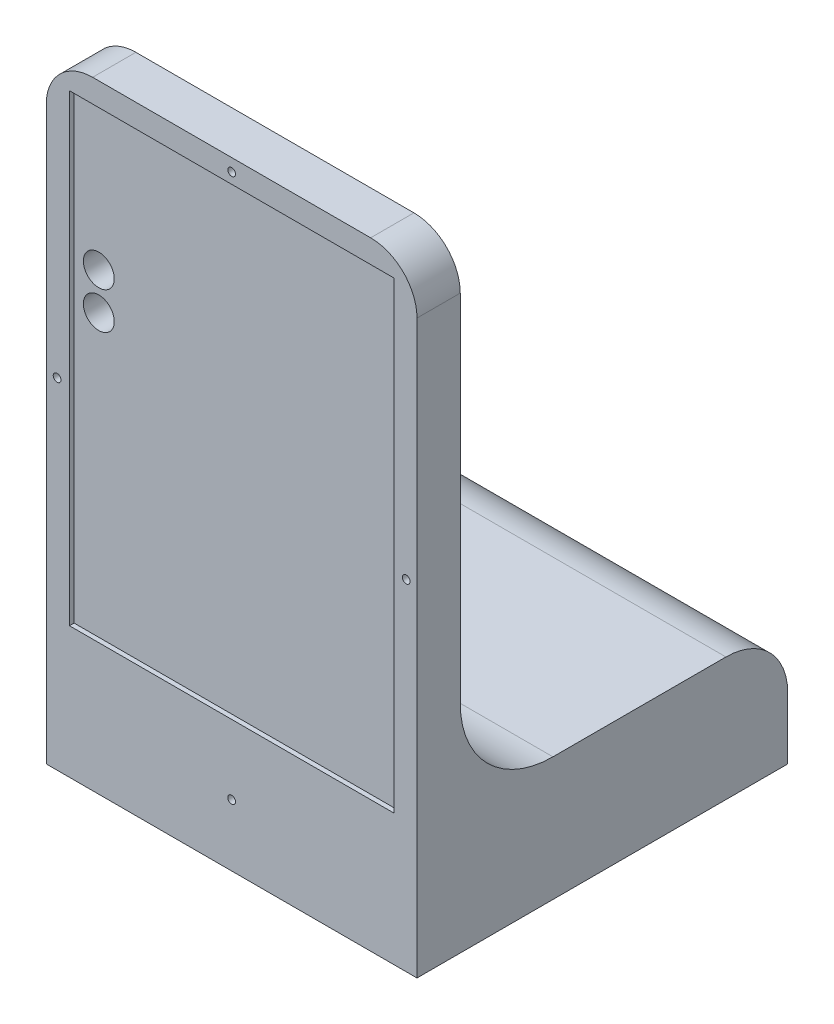
ISO-10303-21;
HEADER;
FILE_DESCRIPTION(('STEP AP214'),'2;1');
FILE_NAME('part.step','',(''),(''),'','','');
FILE_SCHEMA(('AUTOMOTIVE_DESIGN { 1 0 10303 214 1 1 1 1 }'));
ENDSEC;
DATA;
#1=APPLICATION_CONTEXT('core data for automotive mechanical design processes');
#2=APPLICATION_PROTOCOL_DEFINITION('international standard','automotive_design',2000,#1);
#3=PRODUCT_CONTEXT('',#1,'mechanical');
#4=PRODUCT('Part','Part','',(#3));
#5=PRODUCT_RELATED_PRODUCT_CATEGORY('part','',(#4));
#6=PRODUCT_DEFINITION_FORMATION('','',#4);
#7=PRODUCT_DEFINITION_CONTEXT('part definition',#1,'design');
#8=PRODUCT_DEFINITION('design','',#6,#7);
#9=PRODUCT_DEFINITION_SHAPE('','',#8);
#10=(LENGTH_UNIT() NAMED_UNIT(*) SI_UNIT(.MILLI.,.METRE.));
#11=(NAMED_UNIT(*) PLANE_ANGLE_UNIT() SI_UNIT($,.RADIAN.));
#12=(NAMED_UNIT(*) SI_UNIT($,.STERADIAN.) SOLID_ANGLE_UNIT());
#13=UNCERTAINTY_MEASURE_WITH_UNIT(LENGTH_MEASURE(1.E-05),#10,'distance_accuracy_value','');
#14=(GEOMETRIC_REPRESENTATION_CONTEXT(3) GLOBAL_UNCERTAINTY_ASSIGNED_CONTEXT((#13)) GLOBAL_UNIT_ASSIGNED_CONTEXT((#10,
#11,#12)) REPRESENTATION_CONTEXT('',''));
#15=CARTESIAN_POINT('',(0.,0.,0.));
#16=DIRECTION('',(0.,0.,1.));
#17=DIRECTION('',(1.,0.,0.));
#18=AXIS2_PLACEMENT_3D('',#15,#16,#17);
#19=CARTESIAN_POINT('',(0.,200.,25.));
#20=DIRECTION('',(0.,1.,0.));
#21=DIRECTION('',(0.,0.,1.));
#22=AXIS2_PLACEMENT_3D('',#19,#20,#21);
#23=PLANE('',#22);
#24=DIRECTION('',(0.,0.,-1.));
#25=VECTOR('',#24,1.);
#26=CARTESIAN_POINT('',(15.,200.,25.));
#27=LINE('',#26,#25);
#28=CARTESIAN_POINT('',(15.,200.,-25.));
#29=VERTEX_POINT('',#28);
#30=CARTESIAN_POINT('',(15.,200.,-11.));
#31=VERTEX_POINT('',#30);
#32=EDGE_CURVE('E208',#29,#31,#27,.F.);
#33=ORIENTED_EDGE('',*,*,#32,.T.);
#34=DIRECTION('',(-1.,0.,0.));
#35=VECTOR('',#34,1.);
#36=CARTESIAN_POINT('',(120.,200.,-11.));
#37=LINE('',#36,#35);
#38=CARTESIAN_POINT('',(105.,200.,-11.));
#39=VERTEX_POINT('',#38);
#40=EDGE_CURVE('E252',#39,#31,#37,.T.);
#41=ORIENTED_EDGE('',*,*,#40,.F.);
#42=DIRECTION('',(0.,0.,-1.));
#43=VECTOR('',#42,1.);
#44=CARTESIAN_POINT('',(105.,200.,-25.));
#45=LINE('',#44,#43);
#46=CARTESIAN_POINT('',(105.,200.,-25.));
#47=VERTEX_POINT('',#46);
#48=EDGE_CURVE('E205',#39,#47,#45,.T.);
#49=ORIENTED_EDGE('',*,*,#48,.T.);
#50=DIRECTION('',(1.,0.,0.));
#51=VECTOR('',#50,1.);
#52=CARTESIAN_POINT('',(0.,200.,-25.));
#53=LINE('',#52,#51);
#54=EDGE_CURVE('E345',#29,#47,#53,.T.);
#55=ORIENTED_EDGE('',*,*,#54,.F.);
#56=EDGE_LOOP('',(#33,#41,#49,#55));
#57=FACE_BOUND('',#56,.T.);
#58=ADVANCED_FACE('F44',(#57),#23,.T.);
#59=CARTESIAN_POINT('',(0.,0.,25.));
#60=DIRECTION('',(-1.,0.,0.));
#61=DIRECTION('',(0.,0.,1.));
#62=AXIS2_PLACEMENT_3D('',#59,#60,#61);
#63=PLANE('',#62);
#64=DIRECTION('',(0.,0.,1.));
#65=VECTOR('',#64,1.);
#66=CARTESIAN_POINT('',(0.,40.,-165.));
#67=LINE('',#66,#65);
#68=CARTESIAN_POINT('',(0.,40.,-111.));
#69=VERTEX_POINT('',#68);
#70=CARTESIAN_POINT('',(0.,40.,-55.));
#71=VERTEX_POINT('',#70);
#72=EDGE_CURVE('E342',#69,#71,#67,.T.);
#73=ORIENTED_EDGE('',*,*,#72,.F.);
#74=CARTESIAN_POINT('',(0.,20.,-111.));
#75=DIRECTION('',(-1.,0.,0.));
#76=DIRECTION('',(0.,0.,1.));
#77=AXIS2_PLACEMENT_3D('',#74,#75,#76);
#78=CIRCLE('',#77,20.);
#79=CARTESIAN_POINT('',(0.,20.,-131.));
#80=VERTEX_POINT('',#79);
#81=EDGE_CURVE('E11',#69,#80,#78,.T.);
#82=ORIENTED_EDGE('',*,*,#81,.T.);
#83=DIRECTION('',(0.,-1.,0.));
#84=VECTOR('',#83,1.);
#85=CARTESIAN_POINT('',(0.,40.,-131.));
#86=LINE('',#85,#84);
#87=CARTESIAN_POINT('',(0.,0.,-131.));
#88=VERTEX_POINT('',#87);
#89=EDGE_CURVE('E144',#80,#88,#86,.T.);
#90=ORIENTED_EDGE('',*,*,#89,.T.);
#91=DIRECTION('',(0.,0.,-1.));
#92=VECTOR('',#91,1.);
#93=CARTESIAN_POINT('',(0.,0.,25.));
#94=LINE('',#93,#92);
#95=CARTESIAN_POINT('',(0.,0.,-11.));
#96=VERTEX_POINT('',#95);
#97=EDGE_CURVE('E149',#96,#88,#94,.T.);
#98=ORIENTED_EDGE('',*,*,#97,.F.);
#99=DIRECTION('',(0.,1.,0.));
#100=VECTOR('',#99,1.);
#101=CARTESIAN_POINT('',(0.,200.,-11.));
#102=LINE('',#101,#100);
#103=CARTESIAN_POINT('',(0.,185.,-11.));
#104=VERTEX_POINT('',#103);
#105=EDGE_CURVE('E237',#96,#104,#102,.T.);
#106=ORIENTED_EDGE('',*,*,#105,.T.);
#107=DIRECTION('',(0.,0.,-1.));
#108=VECTOR('',#107,1.);
#109=CARTESIAN_POINT('',(0.,185.,25.));
#110=LINE('',#109,#108);
#111=CARTESIAN_POINT('',(0.,185.,-25.));
#112=VERTEX_POINT('',#111);
#113=EDGE_CURVE('E196',#104,#112,#110,.T.);
#114=ORIENTED_EDGE('',*,*,#113,.T.);
#115=DIRECTION('',(0.,1.,0.));
#116=VECTOR('',#115,1.);
#117=CARTESIAN_POINT('',(0.,0.,-25.));
#118=LINE('',#117,#116);
#119=CARTESIAN_POINT('',(0.,70.,-25.));
#120=VERTEX_POINT('',#119);
#121=EDGE_CURVE('E178',#120,#112,#118,.T.);
#122=ORIENTED_EDGE('',*,*,#121,.F.);
#123=CARTESIAN_POINT('',(0.,70.,-55.));
#124=DIRECTION('',(-1.,0.,0.));
#125=DIRECTION('',(0.,0.,1.));
#126=AXIS2_PLACEMENT_3D('',#123,#124,#125);
#127=CIRCLE('',#126,30.);
#128=EDGE_CURVE('E188',#120,#71,#127,.F.);
#129=ORIENTED_EDGE('',*,*,#128,.T.);
#130=EDGE_LOOP('',(#73,#82,#90,#98,#106,#114,#122,#129));
#131=FACE_BOUND('',#130,.T.);
#132=ADVANCED_FACE('F146',(#131),#63,.T.);
#133=CARTESIAN_POINT('',(0.,0.,25.));
#134=DIRECTION('',(0.,1.,0.));
#135=DIRECTION('',(0.,0.,1.));
#136=AXIS2_PLACEMENT_3D('',#133,#134,#135);
#137=PLANE('',#136);
#138=CARTESIAN_POINT('',(76.3226580762109,0.,-105.));
#139=DIRECTION('',(0.,-1.,0.));
#140=DIRECTION('',(0.,0.,-1.));
#141=AXIS2_PLACEMENT_3D('',#138,#139,#140);
#142=CIRCLE('',#141,1.25);
#143=CARTESIAN_POINT('',(76.3226580762109,0.,-106.25));
#144=VERTEX_POINT('',#143);
#145=EDGE_CURVE('E280',#144,#144,#142,.T.);
#146=ORIENTED_EDGE('',*,*,#145,.F.);
#147=EDGE_LOOP('',(#146));
#148=FACE_BOUND('',#147,.T.);
#149=CARTESIAN_POINT('',(46.3226580762109,0.,-105.));
#150=DIRECTION('',(0.,-1.,0.));
#151=DIRECTION('',(0.,0.,-1.));
#152=AXIS2_PLACEMENT_3D('',#149,#150,#151);
#153=CIRCLE('',#152,1.25);
#154=CARTESIAN_POINT('',(46.3226580762109,0.,-106.25));
#155=VERTEX_POINT('',#154);
#156=EDGE_CURVE('E276',#155,#155,#153,.T.);
#157=ORIENTED_EDGE('',*,*,#156,.F.);
#158=EDGE_LOOP('',(#157));
#159=FACE_BOUND('',#158,.T.);
#160=CARTESIAN_POINT('',(45.,0.,-85.));
#161=DIRECTION('',(0.,-1.,0.));
#162=DIRECTION('',(0.,0.,-1.));
#163=AXIS2_PLACEMENT_3D('',#160,#161,#162);
#164=CIRCLE('',#163,1.25);
#165=CARTESIAN_POINT('',(45.,0.,-86.25));
#166=VERTEX_POINT('',#165);
#167=EDGE_CURVE('E285',#166,#166,#164,.T.);
#168=ORIENTED_EDGE('',*,*,#167,.F.);
#169=EDGE_LOOP('',(#168));
#170=FACE_BOUND('',#169,.T.);
#171=CARTESIAN_POINT('',(75.,0.,-85.));
#172=DIRECTION('',(0.,-1.,0.));
#173=DIRECTION('',(0.,0.,-1.));
#174=AXIS2_PLACEMENT_3D('',#171,#172,#173);
#175=CIRCLE('',#174,1.25);
#176=CARTESIAN_POINT('',(75.,0.,-86.25));
#177=VERTEX_POINT('',#176);
#178=EDGE_CURVE('E293',#177,#177,#175,.T.);
#179=ORIENTED_EDGE('',*,*,#178,.F.);
#180=EDGE_LOOP('',(#179));
#181=FACE_BOUND('',#180,.T.);
#182=ORIENTED_EDGE('',*,*,#97,.T.);
#183=DIRECTION('',(1.,0.,0.));
#184=VECTOR('',#183,1.);
#185=CARTESIAN_POINT('',(0.,0.,-131.));
#186=LINE('',#185,#184);
#187=CARTESIAN_POINT('',(120.,0.,-131.));
#188=VERTEX_POINT('',#187);
#189=EDGE_CURVE('E155',#88,#188,#186,.T.);
#190=ORIENTED_EDGE('',*,*,#189,.T.);
#191=DIRECTION('',(0.,0.,-1.));
#192=VECTOR('',#191,1.);
#193=CARTESIAN_POINT('',(120.,0.,25.));
#194=LINE('',#193,#192);
#195=CARTESIAN_POINT('',(120.,0.,-11.));
#196=VERTEX_POINT('',#195);
#197=EDGE_CURVE('E171',#196,#188,#194,.T.);
#198=ORIENTED_EDGE('',*,*,#197,.F.);
#199=DIRECTION('',(-1.,0.,0.));
#200=VECTOR('',#199,1.);
#201=CARTESIAN_POINT('',(120.,0.,-11.));
#202=LINE('',#201,#200);
#203=EDGE_CURVE('E168',#196,#96,#202,.T.);
#204=ORIENTED_EDGE('',*,*,#203,.T.);
#205=EDGE_LOOP('',(#182,#190,#198,#204));
#206=FACE_BOUND('',#205,.T.);
#207=ADVANCED_FACE('F167',(#148,#159,#170,#181,#206),#137,.F.);
#208=CARTESIAN_POINT('',(120.,0.,25.));
#209=DIRECTION('',(-1.,0.,0.));
#210=DIRECTION('',(0.,0.,1.));
#211=AXIS2_PLACEMENT_3D('',#208,#209,#210);
#212=PLANE('',#211);
#213=DIRECTION('',(0.,-1.,0.));
#214=VECTOR('',#213,1.);
#215=CARTESIAN_POINT('',(120.,40.,-131.));
#216=LINE('',#215,#214);
#217=CARTESIAN_POINT('',(120.,20.,-131.));
#218=VERTEX_POINT('',#217);
#219=EDGE_CURVE('E156',#218,#188,#216,.T.);
#220=ORIENTED_EDGE('',*,*,#219,.F.);
#221=CARTESIAN_POINT('',(120.,20.,-111.));
#222=DIRECTION('',(-1.,0.,0.));
#223=DIRECTION('',(0.,0.,1.));
#224=AXIS2_PLACEMENT_3D('',#221,#222,#223);
#225=CIRCLE('',#224,20.);
#226=CARTESIAN_POINT('',(120.,40.,-111.));
#227=VERTEX_POINT('',#226);
#228=EDGE_CURVE('E67',#218,#227,#225,.F.);
#229=ORIENTED_EDGE('',*,*,#228,.T.);
#230=DIRECTION('',(0.,0.,1.));
#231=VECTOR('',#230,1.);
#232=CARTESIAN_POINT('',(120.,40.,-165.));
#233=LINE('',#232,#231);
#234=CARTESIAN_POINT('',(120.,40.,-55.));
#235=VERTEX_POINT('',#234);
#236=EDGE_CURVE('E328',#227,#235,#233,.T.);
#237=ORIENTED_EDGE('',*,*,#236,.T.);
#238=CARTESIAN_POINT('',(120.,70.,-55.));
#239=DIRECTION('',(-1.,0.,0.));
#240=DIRECTION('',(0.,0.,1.));
#241=AXIS2_PLACEMENT_3D('',#238,#239,#240);
#242=CIRCLE('',#241,30.);
#243=CARTESIAN_POINT('',(120.,70.,-25.));
#244=VERTEX_POINT('',#243);
#245=EDGE_CURVE('E185',#235,#244,#242,.T.);
#246=ORIENTED_EDGE('',*,*,#245,.T.);
#247=DIRECTION('',(0.,1.,0.));
#248=VECTOR('',#247,1.);
#249=CARTESIAN_POINT('',(120.,0.,-25.));
#250=LINE('',#249,#248);
#251=CARTESIAN_POINT('',(120.,185.,-25.));
#252=VERTEX_POINT('',#251);
#253=EDGE_CURVE('E348',#244,#252,#250,.T.);
#254=ORIENTED_EDGE('',*,*,#253,.T.);
#255=DIRECTION('',(0.,0.,-1.));
#256=VECTOR('',#255,1.);
#257=CARTESIAN_POINT('',(120.,185.,0.));
#258=LINE('',#257,#256);
#259=CARTESIAN_POINT('',(120.,185.,-11.));
#260=VERTEX_POINT('',#259);
#261=EDGE_CURVE('E192',#252,#260,#258,.F.);
#262=ORIENTED_EDGE('',*,*,#261,.T.);
#263=DIRECTION('',(0.,1.,0.));
#264=VECTOR('',#263,1.);
#265=CARTESIAN_POINT('',(120.,200.,-11.));
#266=LINE('',#265,#264);
#267=EDGE_CURVE('E249',#196,#260,#266,.T.);
#268=ORIENTED_EDGE('',*,*,#267,.F.);
#269=ORIENTED_EDGE('',*,*,#197,.T.);
#270=EDGE_LOOP('',(#220,#229,#237,#246,#254,#262,#268,#269));
#271=FACE_BOUND('',#270,.T.);
#272=ADVANCED_FACE('F222',(#271),#212,.F.);
#273=CARTESIAN_POINT('',(15.,185.,25.));
#274=DIRECTION('',(0.,0.,-1.));
#275=DIRECTION('',(-1.,0.,0.));
#276=AXIS2_PLACEMENT_3D('',#273,#274,#275);
#277=CYLINDRICAL_SURFACE('',#276,15.);
#278=ORIENTED_EDGE('',*,*,#113,.F.);
#279=CARTESIAN_POINT('',(15.,185.,-11.));
#280=DIRECTION('',(0.,0.,1.));
#281=DIRECTION('',(0.,-1.,0.));
#282=AXIS2_PLACEMENT_3D('',#279,#280,#281);
#283=CIRCLE('',#282,15.);
#284=EDGE_CURVE('E259',#104,#31,#283,.F.);
#285=ORIENTED_EDGE('',*,*,#284,.T.);
#286=ORIENTED_EDGE('',*,*,#32,.F.);
#287=CARTESIAN_POINT('',(15.,185.,-25.));
#288=DIRECTION('',(0.,0.,1.));
#289=DIRECTION('',(1.,0.,0.));
#290=AXIS2_PLACEMENT_3D('',#287,#288,#289);
#291=CIRCLE('',#290,15.);
#292=EDGE_CURVE('E202',#112,#29,#291,.F.);
#293=ORIENTED_EDGE('',*,*,#292,.F.);
#294=EDGE_LOOP('',(#278,#285,#286,#293));
#295=FACE_BOUND('',#294,.T.);
#296=ADVANCED_FACE('F392',(#295),#277,.T.);
#297=CARTESIAN_POINT('',(105.,185.,25.));
#298=DIRECTION('',(0.,0.,1.));
#299=DIRECTION('',(1.,0.,0.));
#300=AXIS2_PLACEMENT_3D('',#297,#298,#299);
#301=CYLINDRICAL_SURFACE('',#300,15.);
#302=ORIENTED_EDGE('',*,*,#48,.F.);
#303=CARTESIAN_POINT('',(105.,185.,-11.));
#304=DIRECTION('',(0.,0.,1.));
#305=DIRECTION('',(0.,-1.,0.));
#306=AXIS2_PLACEMENT_3D('',#303,#304,#305);
#307=CIRCLE('',#306,15.);
#308=EDGE_CURVE('E212',#39,#260,#307,.F.);
#309=ORIENTED_EDGE('',*,*,#308,.T.);
#310=ORIENTED_EDGE('',*,*,#261,.F.);
#311=CARTESIAN_POINT('',(105.,185.,-25.));
#312=DIRECTION('',(0.,0.,1.));
#313=DIRECTION('',(1.,0.,0.));
#314=AXIS2_PLACEMENT_3D('',#311,#312,#313);
#315=CIRCLE('',#314,15.);
#316=EDGE_CURVE('E199',#47,#252,#315,.F.);
#317=ORIENTED_EDGE('',*,*,#316,.F.);
#318=EDGE_LOOP('',(#302,#309,#310,#317));
#319=FACE_BOUND('',#318,.T.);
#320=ADVANCED_FACE('F394',(#319),#301,.T.);
#321=CARTESIAN_POINT('',(0.,0.,-25.));
#322=DIRECTION('',(0.,0.,1.));
#323=DIRECTION('',(1.,0.,0.));
#324=AXIS2_PLACEMENT_3D('',#321,#322,#323);
#325=PLANE('',#324);
#326=CARTESIAN_POINT('',(3.5,110.,-25.));
#327=DIRECTION('',(0.,0.,1.));
#328=DIRECTION('',(1.,0.,0.));
#329=AXIS2_PLACEMENT_3D('',#326,#327,#328);
#330=CIRCLE('',#329,1.25);
#331=CARTESIAN_POINT('',(4.75,110.,-25.));
#332=VERTEX_POINT('',#331);
#333=EDGE_CURVE('E811',#332,#332,#330,.T.);
#334=ORIENTED_EDGE('',*,*,#333,.T.);
#335=EDGE_LOOP('',(#334));
#336=FACE_BOUND('',#335,.T.);
#337=CARTESIAN_POINT('',(116.5,110.,-25.));
#338=DIRECTION('',(0.,0.,1.));
#339=DIRECTION('',(1.,0.,0.));
#340=AXIS2_PLACEMENT_3D('',#337,#338,#339);
#341=CIRCLE('',#340,1.25);
#342=CARTESIAN_POINT('',(117.75,110.,-25.));
#343=VERTEX_POINT('',#342);
#344=EDGE_CURVE('E813',#343,#343,#341,.T.);
#345=ORIENTED_EDGE('',*,*,#344,.T.);
#346=EDGE_LOOP('',(#345));
#347=FACE_BOUND('',#346,.T.);
#348=CARTESIAN_POINT('',(60.,195.964841853792,-25.));
#349=DIRECTION('',(0.,0.,1.));
#350=DIRECTION('',(1.,0.,0.));
#351=AXIS2_PLACEMENT_3D('',#348,#349,#350);
#352=CIRCLE('',#351,1.25);
#353=CARTESIAN_POINT('',(61.25,195.964841853792,-25.));
#354=VERTEX_POINT('',#353);
#355=EDGE_CURVE('E819',#354,#354,#352,.T.);
#356=ORIENTED_EDGE('',*,*,#355,.T.);
#357=EDGE_LOOP('',(#356));
#358=FACE_BOUND('',#357,.T.);
#359=ORIENTED_EDGE('',*,*,#121,.T.);
#360=ORIENTED_EDGE('',*,*,#292,.T.);
#361=ORIENTED_EDGE('',*,*,#54,.T.);
#362=ORIENTED_EDGE('',*,*,#316,.T.);
#363=ORIENTED_EDGE('',*,*,#253,.F.);
#364=DIRECTION('',(1.,0.,0.));
#365=VECTOR('',#364,1.);
#366=CARTESIAN_POINT('',(0.,70.,-25.));
#367=LINE('',#366,#365);
#368=EDGE_CURVE('E176',#244,#120,#367,.F.);
#369=ORIENTED_EDGE('',*,*,#368,.T.);
#370=EDGE_LOOP('',(#359,#360,#361,#362,#363,#369));
#371=FACE_BOUND('',#370,.T.);
#372=ADVANCED_FACE('F357',(#336,#347,#358,#371),#325,.F.);
#373=CARTESIAN_POINT('',(0.,40.,-165.));
#374=DIRECTION('',(0.,-1.,0.));
#375=DIRECTION('',(1.,0.,0.));
#376=AXIS2_PLACEMENT_3D('',#373,#374,#375);
#377=PLANE('',#376);
#378=ORIENTED_EDGE('',*,*,#236,.F.);
#379=DIRECTION('',(1.,0.,0.));
#380=VECTOR('',#379,1.);
#381=CARTESIAN_POINT('',(0.,40.,-111.));
#382=LINE('',#381,#380);
#383=EDGE_CURVE('E53',#227,#69,#382,.F.);
#384=ORIENTED_EDGE('',*,*,#383,.T.);
#385=ORIENTED_EDGE('',*,*,#72,.T.);
#386=DIRECTION('',(1.,0.,0.));
#387=VECTOR('',#386,1.);
#388=CARTESIAN_POINT('',(120.,40.,-55.));
#389=LINE('',#388,#387);
#390=EDGE_CURVE('E170',#71,#235,#389,.T.);
#391=ORIENTED_EDGE('',*,*,#390,.T.);
#392=EDGE_LOOP('',(#378,#384,#385,#391));
#393=FACE_BOUND('',#392,.T.);
#394=ADVANCED_FACE('F367',(#393),#377,.F.);
#395=CARTESIAN_POINT('',(0.,70.,-55.));
#396=DIRECTION('',(-1.,0.,0.));
#397=DIRECTION('',(0.,-1.,0.));
#398=AXIS2_PLACEMENT_3D('',#395,#396,#397);
#399=CYLINDRICAL_SURFACE('',#398,30.);
#400=ORIENTED_EDGE('',*,*,#128,.F.);
#401=ORIENTED_EDGE('',*,*,#368,.F.);
#402=ORIENTED_EDGE('',*,*,#245,.F.);
#403=ORIENTED_EDGE('',*,*,#390,.F.);
#404=EDGE_LOOP('',(#400,#401,#402,#403));
#405=FACE_BOUND('',#404,.T.);
#406=ADVANCED_FACE('F365',(#405),#399,.F.);
#407=CARTESIAN_POINT('',(76.3226580762109,5.,-105.));
#408=DIRECTION('',(0.,-1.,0.));
#409=DIRECTION('',(0.,0.,-1.));
#410=AXIS2_PLACEMENT_3D('',#407,#408,#409);
#411=CYLINDRICAL_SURFACE('',#410,1.25);
#412=CARTESIAN_POINT('',(76.3226580762109,5.,-105.));
#413=DIRECTION('',(0.,-1.,0.));
#414=DIRECTION('',(0.,0.,-1.));
#415=AXIS2_PLACEMENT_3D('',#412,#413,#414);
#416=CIRCLE('',#415,1.25);
#417=CARTESIAN_POINT('',(76.3226580762109,5.,-106.25));
#418=VERTEX_POINT('',#417);
#419=EDGE_CURVE('E300',#418,#418,#416,.T.);
#420=ORIENTED_EDGE('',*,*,#419,.F.);
#421=EDGE_LOOP('',(#420));
#422=FACE_BOUND('',#421,.T.);
#423=ORIENTED_EDGE('',*,*,#145,.T.);
#424=EDGE_LOOP('',(#423));
#425=FACE_BOUND('',#424,.T.);
#426=ADVANCED_FACE('F391',(#422,#425),#411,.F.);
#427=CARTESIAN_POINT('',(76.3226580762109,5.,-105.));
#428=DIRECTION('',(0.,-1.,0.));
#429=DIRECTION('',(0.,0.,-1.));
#430=AXIS2_PLACEMENT_3D('',#427,#428,#429);
#431=PLANE('',#430);
#432=ORIENTED_EDGE('',*,*,#419,.T.);
#433=EDGE_LOOP('',(#432));
#434=FACE_BOUND('',#433,.T.);
#435=ADVANCED_FACE('F477',(#434),#431,.T.);
#436=CARTESIAN_POINT('',(46.3226580762109,5.,-105.));
#437=DIRECTION('',(0.,-1.,0.));
#438=DIRECTION('',(0.,0.,-1.));
#439=AXIS2_PLACEMENT_3D('',#436,#437,#438);
#440=CYLINDRICAL_SURFACE('',#439,1.25);
#441=CARTESIAN_POINT('',(46.3226580762109,5.,-105.));
#442=DIRECTION('',(0.,-1.,0.));
#443=DIRECTION('',(0.,0.,-1.));
#444=AXIS2_PLACEMENT_3D('',#441,#442,#443);
#445=CIRCLE('',#444,1.25);
#446=CARTESIAN_POINT('',(46.3226580762109,5.,-106.25));
#447=VERTEX_POINT('',#446);
#448=EDGE_CURVE('E281',#447,#447,#445,.T.);
#449=ORIENTED_EDGE('',*,*,#448,.F.);
#450=EDGE_LOOP('',(#449));
#451=FACE_BOUND('',#450,.T.);
#452=ORIENTED_EDGE('',*,*,#156,.T.);
#453=EDGE_LOOP('',(#452));
#454=FACE_BOUND('',#453,.T.);
#455=ADVANCED_FACE('F480',(#451,#454),#440,.F.);
#456=CARTESIAN_POINT('',(46.3226580762109,5.,-105.));
#457=DIRECTION('',(0.,-1.,0.));
#458=DIRECTION('',(0.,0.,-1.));
#459=AXIS2_PLACEMENT_3D('',#456,#457,#458);
#460=PLANE('',#459);
#461=ORIENTED_EDGE('',*,*,#448,.T.);
#462=EDGE_LOOP('',(#461));
#463=FACE_BOUND('',#462,.T.);
#464=ADVANCED_FACE('F711',(#463),#460,.T.);
#465=CARTESIAN_POINT('',(45.,5.,-85.));
#466=DIRECTION('',(0.,-1.,0.));
#467=DIRECTION('',(0.,0.,-1.));
#468=AXIS2_PLACEMENT_3D('',#465,#466,#467);
#469=CYLINDRICAL_SURFACE('',#468,1.25);
#470=CARTESIAN_POINT('',(45.,5.,-85.));
#471=DIRECTION('',(0.,-1.,0.));
#472=DIRECTION('',(0.,0.,-1.));
#473=AXIS2_PLACEMENT_3D('',#470,#471,#472);
#474=CIRCLE('',#473,1.25);
#475=CARTESIAN_POINT('',(45.,5.,-86.25));
#476=VERTEX_POINT('',#475);
#477=EDGE_CURVE('E289',#476,#476,#474,.T.);
#478=ORIENTED_EDGE('',*,*,#477,.F.);
#479=EDGE_LOOP('',(#478));
#480=FACE_BOUND('',#479,.T.);
#481=ORIENTED_EDGE('',*,*,#167,.T.);
#482=EDGE_LOOP('',(#481));
#483=FACE_BOUND('',#482,.T.);
#484=ADVANCED_FACE('F471',(#480,#483),#469,.F.);
#485=CARTESIAN_POINT('',(45.,5.,-85.));
#486=DIRECTION('',(0.,-1.,0.));
#487=DIRECTION('',(0.,0.,-1.));
#488=AXIS2_PLACEMENT_3D('',#485,#486,#487);
#489=PLANE('',#488);
#490=ORIENTED_EDGE('',*,*,#477,.T.);
#491=EDGE_LOOP('',(#490));
#492=FACE_BOUND('',#491,.T.);
#493=ADVANCED_FACE('F462',(#492),#489,.T.);
#494=CARTESIAN_POINT('',(75.,5.,-85.));
#495=DIRECTION('',(0.,-1.,0.));
#496=DIRECTION('',(0.,0.,-1.));
#497=AXIS2_PLACEMENT_3D('',#494,#495,#496);
#498=CYLINDRICAL_SURFACE('',#497,1.25);
#499=CARTESIAN_POINT('',(75.,5.,-85.));
#500=DIRECTION('',(0.,-1.,0.));
#501=DIRECTION('',(0.,0.,-1.));
#502=AXIS2_PLACEMENT_3D('',#499,#500,#501);
#503=CIRCLE('',#502,1.25);
#504=CARTESIAN_POINT('',(75.,5.,-86.25));
#505=VERTEX_POINT('',#504);
#506=EDGE_CURVE('E275',#505,#505,#503,.T.);
#507=ORIENTED_EDGE('',*,*,#506,.F.);
#508=EDGE_LOOP('',(#507));
#509=FACE_BOUND('',#508,.T.);
#510=ORIENTED_EDGE('',*,*,#178,.T.);
#511=EDGE_LOOP('',(#510));
#512=FACE_BOUND('',#511,.T.);
#513=ADVANCED_FACE('F460',(#509,#512),#498,.F.);
#514=CARTESIAN_POINT('',(75.,5.,-85.));
#515=DIRECTION('',(0.,-1.,0.));
#516=DIRECTION('',(0.,0.,-1.));
#517=AXIS2_PLACEMENT_3D('',#514,#515,#516);
#518=PLANE('',#517);
#519=ORIENTED_EDGE('',*,*,#506,.T.);
#520=EDGE_LOOP('',(#519));
#521=FACE_BOUND('',#520,.T.);
#522=ADVANCED_FACE('F412',(#521),#518,.T.);
#523=CARTESIAN_POINT('',(120.,200.,-11.));
#524=DIRECTION('',(0.,0.,1.));
#525=DIRECTION('',(0.,-1.,0.));
#526=AXIS2_PLACEMENT_3D('',#523,#524,#525);
#527=PLANE('',#526);
#528=CARTESIAN_POINT('',(3.5,110.,-11.));
#529=DIRECTION('',(0.,0.,1.));
#530=DIRECTION('',(1.,0.,0.));
#531=AXIS2_PLACEMENT_3D('',#528,#529,#530);
#532=CIRCLE('',#531,1.25);
#533=CARTESIAN_POINT('',(4.75,110.,-11.));
#534=VERTEX_POINT('',#533);
#535=EDGE_CURVE('E808',#534,#534,#532,.T.);
#536=ORIENTED_EDGE('',*,*,#535,.F.);
#537=EDGE_LOOP('',(#536));
#538=FACE_BOUND('',#537,.T.);
#539=CARTESIAN_POINT('',(116.5,110.,-11.));
#540=DIRECTION('',(0.,0.,1.));
#541=DIRECTION('',(1.,0.,0.));
#542=AXIS2_PLACEMENT_3D('',#539,#540,#541);
#543=CIRCLE('',#542,1.25);
#544=CARTESIAN_POINT('',(117.75,110.,-11.));
#545=VERTEX_POINT('',#544);
#546=EDGE_CURVE('E829',#545,#545,#543,.T.);
#547=ORIENTED_EDGE('',*,*,#546,.F.);
#548=EDGE_LOOP('',(#547));
#549=FACE_BOUND('',#548,.T.);
#550=CARTESIAN_POINT('',(60.,195.964841853792,-11.));
#551=DIRECTION('',(0.,0.,1.));
#552=DIRECTION('',(1.,0.,0.));
#553=AXIS2_PLACEMENT_3D('',#550,#551,#552);
#554=CIRCLE('',#553,1.25);
#555=CARTESIAN_POINT('',(61.25,195.964841853792,-11.));
#556=VERTEX_POINT('',#555);
#557=EDGE_CURVE('E825',#556,#556,#554,.T.);
#558=ORIENTED_EDGE('',*,*,#557,.F.);
#559=EDGE_LOOP('',(#558));
#560=FACE_BOUND('',#559,.T.);
#561=CARTESIAN_POINT('',(60.,20.,-11.));
#562=DIRECTION('',(0.,0.,1.));
#563=DIRECTION('',(1.,0.,0.));
#564=AXIS2_PLACEMENT_3D('',#561,#562,#563);
#565=CIRCLE('',#564,1.25);
#566=CARTESIAN_POINT('',(61.25,20.,-11.));
#567=VERTEX_POINT('',#566);
#568=EDGE_CURVE('E229',#567,#567,#565,.T.);
#569=ORIENTED_EDGE('',*,*,#568,.F.);
#570=EDGE_LOOP('',(#569));
#571=FACE_BOUND('',#570,.T.);
#572=ORIENTED_EDGE('',*,*,#105,.F.);
#573=ORIENTED_EDGE('',*,*,#203,.F.);
#574=ORIENTED_EDGE('',*,*,#267,.T.);
#575=ORIENTED_EDGE('',*,*,#308,.F.);
#576=ORIENTED_EDGE('',*,*,#40,.T.);
#577=ORIENTED_EDGE('',*,*,#284,.F.);
#578=EDGE_LOOP('',(#572,#573,#574,#575,#576,#577));
#579=FACE_BOUND('',#578,.T.);
#580=DIRECTION('',(0.,1.,0.));
#581=VECTOR('',#580,1.);
#582=CARTESIAN_POINT('',(7.49999999999999,192.5,-11.));
#583=LINE('',#582,#581);
#584=CARTESIAN_POINT('',(7.50000000000001,42.5,-11.));
#585=VERTEX_POINT('',#584);
#586=CARTESIAN_POINT('',(7.49999999999999,192.5,-11.));
#587=VERTEX_POINT('',#586);
#588=EDGE_CURVE('E272',#585,#587,#583,.T.);
#589=ORIENTED_EDGE('',*,*,#588,.T.);
#590=DIRECTION('',(1.,0.,0.));
#591=VECTOR('',#590,1.);
#592=CARTESIAN_POINT('',(7.49999999999999,192.5,-11.));
#593=LINE('',#592,#591);
#594=CARTESIAN_POINT('',(112.5,192.5,-11.));
#595=VERTEX_POINT('',#594);
#596=EDGE_CURVE('E269',#587,#595,#593,.T.);
#597=ORIENTED_EDGE('',*,*,#596,.T.);
#598=DIRECTION('',(0.,-1.,0.));
#599=VECTOR('',#598,1.);
#600=CARTESIAN_POINT('',(112.5,192.5,-11.));
#601=LINE('',#600,#599);
#602=CARTESIAN_POINT('',(112.5,42.5,-11.));
#603=VERTEX_POINT('',#602);
#604=EDGE_CURVE('E266',#595,#603,#601,.T.);
#605=ORIENTED_EDGE('',*,*,#604,.T.);
#606=DIRECTION('',(-1.,0.,0.));
#607=VECTOR('',#606,1.);
#608=CARTESIAN_POINT('',(7.50000000000001,42.5,-11.));
#609=LINE('',#608,#607);
#610=EDGE_CURVE('E263',#603,#585,#609,.T.);
#611=ORIENTED_EDGE('',*,*,#610,.T.);
#612=EDGE_LOOP('',(#589,#597,#605,#611));
#613=FACE_BOUND('',#612,.T.);
#614=ADVANCED_FACE('F408',(#538,#549,#560,#571,#579,#613),#527,.T.);
#615=CARTESIAN_POINT('',(0.,0.,-12.5));
#616=DIRECTION('',(0.,0.,1.));
#617=DIRECTION('',(1.,0.,0.));
#618=AXIS2_PLACEMENT_3D('',#615,#616,#617);
#619=PLANE('',#618);
#620=CARTESIAN_POINT('',(15.5,145.5,-12.5));
#621=DIRECTION('',(0.,0.,1.));
#622=DIRECTION('',(1.,0.,0.));
#623=AXIS2_PLACEMENT_3D('',#620,#621,#622);
#624=CIRCLE('',#623,5.);
#625=CARTESIAN_POINT('',(20.5,145.5,-12.5));
#626=VERTEX_POINT('',#625);
#627=EDGE_CURVE('E238',#626,#626,#624,.T.);
#628=ORIENTED_EDGE('',*,*,#627,.F.);
#629=EDGE_LOOP('',(#628));
#630=FACE_BOUND('',#629,.T.);
#631=CARTESIAN_POINT('',(15.5,133.5,-12.5));
#632=DIRECTION('',(0.,0.,1.));
#633=DIRECTION('',(1.,0.,0.));
#634=AXIS2_PLACEMENT_3D('',#631,#632,#633);
#635=CIRCLE('',#634,5.);
#636=CARTESIAN_POINT('',(20.5,133.5,-12.5));
#637=VERTEX_POINT('',#636);
#638=EDGE_CURVE('E242',#637,#637,#635,.T.);
#639=ORIENTED_EDGE('',*,*,#638,.F.);
#640=EDGE_LOOP('',(#639));
#641=FACE_BOUND('',#640,.T.);
#642=DIRECTION('',(0.,-1.,0.));
#643=VECTOR('',#642,1.);
#644=CARTESIAN_POINT('',(7.49999999999999,192.5,-12.5));
#645=LINE('',#644,#643);
#646=CARTESIAN_POINT('',(7.49999999999999,192.5,-12.5));
#647=VERTEX_POINT('',#646);
#648=CARTESIAN_POINT('',(7.50000000000001,42.5,-12.5));
#649=VERTEX_POINT('',#648);
#650=EDGE_CURVE('E304',#647,#649,#645,.T.);
#651=ORIENTED_EDGE('',*,*,#650,.T.);
#652=DIRECTION('',(1.,0.,0.));
#653=VECTOR('',#652,1.);
#654=CARTESIAN_POINT('',(7.50000000000001,42.5,-12.5));
#655=LINE('',#654,#653);
#656=CARTESIAN_POINT('',(112.5,42.5,-12.5));
#657=VERTEX_POINT('',#656);
#658=EDGE_CURVE('E311',#649,#657,#655,.T.);
#659=ORIENTED_EDGE('',*,*,#658,.T.);
#660=DIRECTION('',(0.,1.,0.));
#661=VECTOR('',#660,1.);
#662=CARTESIAN_POINT('',(112.5,192.5,-12.5));
#663=LINE('',#662,#661);
#664=CARTESIAN_POINT('',(112.5,192.5,-12.5));
#665=VERTEX_POINT('',#664);
#666=EDGE_CURVE('E315',#657,#665,#663,.T.);
#667=ORIENTED_EDGE('',*,*,#666,.T.);
#668=DIRECTION('',(-1.,0.,0.));
#669=VECTOR('',#668,1.);
#670=CARTESIAN_POINT('',(7.49999999999999,192.5,-12.5));
#671=LINE('',#670,#669);
#672=EDGE_CURVE('E319',#665,#647,#671,.T.);
#673=ORIENTED_EDGE('',*,*,#672,.T.);
#674=EDGE_LOOP('',(#651,#659,#667,#673));
#675=FACE_BOUND('',#674,.T.);
#676=ADVANCED_FACE('F411',(#630,#641,#675),#619,.T.);
#677=CARTESIAN_POINT('',(7.50000000000001,42.5,-12.5));
#678=DIRECTION('',(0.,-1.,0.));
#679=DIRECTION('',(0.,0.,-1.));
#680=AXIS2_PLACEMENT_3D('',#677,#678,#679);
#681=PLANE('',#680);
#682=ORIENTED_EDGE('',*,*,#610,.F.);
#683=DIRECTION('',(0.,0.,1.));
#684=VECTOR('',#683,1.);
#685=CARTESIAN_POINT('',(112.5,42.5,-12.5));
#686=LINE('',#685,#684);
#687=EDGE_CURVE('E333',#657,#603,#686,.T.);
#688=ORIENTED_EDGE('',*,*,#687,.F.);
#689=ORIENTED_EDGE('',*,*,#658,.F.);
#690=DIRECTION('',(0.,0.,1.));
#691=VECTOR('',#690,1.);
#692=CARTESIAN_POINT('',(7.50000000000001,42.5,-12.5));
#693=LINE('',#692,#691);
#694=EDGE_CURVE('E323',#649,#585,#693,.T.);
#695=ORIENTED_EDGE('',*,*,#694,.T.);
#696=EDGE_LOOP('',(#682,#688,#689,#695));
#697=FACE_BOUND('',#696,.T.);
#698=ADVANCED_FACE('F431',(#697),#681,.F.);
#699=CARTESIAN_POINT('',(112.5,192.5,-12.5));
#700=DIRECTION('',(1.,0.,0.));
#701=DIRECTION('',(0.,1.,0.));
#702=AXIS2_PLACEMENT_3D('',#699,#700,#701);
#703=PLANE('',#702);
#704=ORIENTED_EDGE('',*,*,#604,.F.);
#705=DIRECTION('',(0.,0.,1.));
#706=VECTOR('',#705,1.);
#707=CARTESIAN_POINT('',(112.5,192.5,-12.5));
#708=LINE('',#707,#706);
#709=EDGE_CURVE('E329',#665,#595,#708,.T.);
#710=ORIENTED_EDGE('',*,*,#709,.F.);
#711=ORIENTED_EDGE('',*,*,#666,.F.);
#712=ORIENTED_EDGE('',*,*,#687,.T.);
#713=EDGE_LOOP('',(#704,#710,#711,#712));
#714=FACE_BOUND('',#713,.T.);
#715=ADVANCED_FACE('F429',(#714),#703,.F.);
#716=CARTESIAN_POINT('',(7.49999999999999,192.5,-12.5));
#717=DIRECTION('',(0.,1.,0.));
#718=DIRECTION('',(0.,0.,1.));
#719=AXIS2_PLACEMENT_3D('',#716,#717,#718);
#720=PLANE('',#719);
#721=ORIENTED_EDGE('',*,*,#596,.F.);
#722=DIRECTION('',(0.,0.,1.));
#723=VECTOR('',#722,1.);
#724=CARTESIAN_POINT('',(7.49999999999999,192.5,-12.5));
#725=LINE('',#724,#723);
#726=EDGE_CURVE('E324',#647,#587,#725,.T.);
#727=ORIENTED_EDGE('',*,*,#726,.F.);
#728=ORIENTED_EDGE('',*,*,#672,.F.);
#729=ORIENTED_EDGE('',*,*,#709,.T.);
#730=EDGE_LOOP('',(#721,#727,#728,#729));
#731=FACE_BOUND('',#730,.T.);
#732=ADVANCED_FACE('F421',(#731),#720,.F.);
#733=CARTESIAN_POINT('',(7.49999999999999,192.5,-12.5));
#734=DIRECTION('',(-1.,0.,0.));
#735=DIRECTION('',(0.,-1.,0.));
#736=AXIS2_PLACEMENT_3D('',#733,#734,#735);
#737=PLANE('',#736);
#738=ORIENTED_EDGE('',*,*,#588,.F.);
#739=ORIENTED_EDGE('',*,*,#694,.F.);
#740=ORIENTED_EDGE('',*,*,#650,.F.);
#741=ORIENTED_EDGE('',*,*,#726,.T.);
#742=EDGE_LOOP('',(#738,#739,#740,#741));
#743=FACE_BOUND('',#742,.T.);
#744=ADVANCED_FACE('F424',(#743),#737,.F.);
#745=CARTESIAN_POINT('',(15.5,133.5,-23.5));
#746=DIRECTION('',(0.,0.,1.));
#747=DIRECTION('',(1.,0.,0.));
#748=AXIS2_PLACEMENT_3D('',#745,#746,#747);
#749=CYLINDRICAL_SURFACE('',#748,5.);
#750=CARTESIAN_POINT('',(15.5,133.5,-23.5));
#751=DIRECTION('',(0.,0.,1.));
#752=DIRECTION('',(1.,0.,0.));
#753=AXIS2_PLACEMENT_3D('',#750,#751,#752);
#754=CIRCLE('',#753,5.);
#755=CARTESIAN_POINT('',(20.5,133.5,-23.5));
#756=VERTEX_POINT('',#755);
#757=EDGE_CURVE('E164',#756,#756,#754,.T.);
#758=ORIENTED_EDGE('',*,*,#757,.F.);
#759=EDGE_LOOP('',(#758));
#760=FACE_BOUND('',#759,.T.);
#761=ORIENTED_EDGE('',*,*,#638,.T.);
#762=EDGE_LOOP('',(#761));
#763=FACE_BOUND('',#762,.T.);
#764=ADVANCED_FACE('F445',(#760,#763),#749,.F.);
#765=CARTESIAN_POINT('',(15.5,133.5,-23.5));
#766=DIRECTION('',(0.,0.,1.));
#767=DIRECTION('',(1.,0.,0.));
#768=AXIS2_PLACEMENT_3D('',#765,#766,#767);
#769=PLANE('',#768);
#770=ORIENTED_EDGE('',*,*,#757,.T.);
#771=EDGE_LOOP('',(#770));
#772=FACE_BOUND('',#771,.T.);
#773=ADVANCED_FACE('F500',(#772),#769,.T.);
#774=CARTESIAN_POINT('',(15.5,145.5,-23.5));
#775=DIRECTION('',(0.,0.,1.));
#776=DIRECTION('',(1.,0.,0.));
#777=AXIS2_PLACEMENT_3D('',#774,#775,#776);
#778=CYLINDRICAL_SURFACE('',#777,5.);
#779=CARTESIAN_POINT('',(15.5,145.5,-23.5));
#780=DIRECTION('',(0.,0.,1.));
#781=DIRECTION('',(1.,0.,0.));
#782=AXIS2_PLACEMENT_3D('',#779,#780,#781);
#783=CIRCLE('',#782,5.);
#784=CARTESIAN_POINT('',(20.5,145.5,-23.5));
#785=VERTEX_POINT('',#784);
#786=EDGE_CURVE('E233',#785,#785,#783,.T.);
#787=ORIENTED_EDGE('',*,*,#786,.F.);
#788=EDGE_LOOP('',(#787));
#789=FACE_BOUND('',#788,.T.);
#790=ORIENTED_EDGE('',*,*,#627,.T.);
#791=EDGE_LOOP('',(#790));
#792=FACE_BOUND('',#791,.T.);
#793=ADVANCED_FACE('F508',(#789,#792),#778,.F.);
#794=CARTESIAN_POINT('',(15.5,145.5,-23.5));
#795=DIRECTION('',(0.,0.,1.));
#796=DIRECTION('',(1.,0.,0.));
#797=AXIS2_PLACEMENT_3D('',#794,#795,#796);
#798=PLANE('',#797);
#799=ORIENTED_EDGE('',*,*,#786,.T.);
#800=EDGE_LOOP('',(#799));
#801=FACE_BOUND('',#800,.T.);
#802=ADVANCED_FACE('F377',(#801),#798,.T.);
#803=CARTESIAN_POINT('',(0.,40.,-131.));
#804=DIRECTION('',(0.,0.,1.));
#805=DIRECTION('',(1.,0.,0.));
#806=AXIS2_PLACEMENT_3D('',#803,#804,#805);
#807=PLANE('',#806);
#808=ORIENTED_EDGE('',*,*,#89,.F.);
#809=DIRECTION('',(1.,0.,0.));
#810=VECTOR('',#809,1.);
#811=CARTESIAN_POINT('',(0.,20.,-131.));
#812=LINE('',#811,#810);
#813=EDGE_CURVE('E216',#80,#218,#812,.T.);
#814=ORIENTED_EDGE('',*,*,#813,.T.);
#815=ORIENTED_EDGE('',*,*,#219,.T.);
#816=ORIENTED_EDGE('',*,*,#189,.F.);
#817=EDGE_LOOP('',(#808,#814,#815,#816));
#818=FACE_BOUND('',#817,.T.);
#819=ADVANCED_FACE('F159',(#818),#807,.F.);
#820=CARTESIAN_POINT('',(0.,20.,-111.));
#821=DIRECTION('',(1.,0.,0.));
#822=DIRECTION('',(0.,1.,0.));
#823=AXIS2_PLACEMENT_3D('',#820,#821,#822);
#824=CYLINDRICAL_SURFACE('',#823,20.);
#825=ORIENTED_EDGE('',*,*,#81,.F.);
#826=ORIENTED_EDGE('',*,*,#383,.F.);
#827=ORIENTED_EDGE('',*,*,#228,.F.);
#828=ORIENTED_EDGE('',*,*,#813,.F.);
#829=EDGE_LOOP('',(#825,#826,#827,#828));
#830=FACE_BOUND('',#829,.T.);
#831=ADVANCED_FACE('F46',(#830),#824,.T.);
#832=CARTESIAN_POINT('',(60.,20.,-15.));
#833=DIRECTION('',(0.,0.,1.));
#834=DIRECTION('',(1.,0.,0.));
#835=AXIS2_PLACEMENT_3D('',#832,#833,#834);
#836=CYLINDRICAL_SURFACE('',#835,1.25);
#837=CARTESIAN_POINT('',(60.,20.,-15.));
#838=DIRECTION('',(0.,0.,1.));
#839=DIRECTION('',(1.,0.,0.));
#840=AXIS2_PLACEMENT_3D('',#837,#838,#839);
#841=CIRCLE('',#840,1.25);
#842=CARTESIAN_POINT('',(61.25,20.,-15.));
#843=VERTEX_POINT('',#842);
#844=EDGE_CURVE('E225',#843,#843,#841,.T.);
#845=ORIENTED_EDGE('',*,*,#844,.F.);
#846=EDGE_LOOP('',(#845));
#847=FACE_BOUND('',#846,.T.);
#848=ORIENTED_EDGE('',*,*,#568,.T.);
#849=EDGE_LOOP('',(#848));
#850=FACE_BOUND('',#849,.T.);
#851=ADVANCED_FACE('F369',(#847,#850),#836,.F.);
#852=CARTESIAN_POINT('',(60.,20.,-15.));
#853=DIRECTION('',(0.,0.,1.));
#854=DIRECTION('',(1.,0.,0.));
#855=AXIS2_PLACEMENT_3D('',#852,#853,#854);
#856=PLANE('',#855);
#857=ORIENTED_EDGE('',*,*,#844,.T.);
#858=EDGE_LOOP('',(#857));
#859=FACE_BOUND('',#858,.T.);
#860=ADVANCED_FACE('F374',(#859),#856,.T.);
#861=CARTESIAN_POINT('',(60.,195.964841853792,-131.));
#862=DIRECTION('',(0.,0.,1.));
#863=DIRECTION('',(1.,0.,0.));
#864=AXIS2_PLACEMENT_3D('',#861,#862,#863);
#865=CYLINDRICAL_SURFACE('',#864,1.25);
#866=ORIENTED_EDGE('',*,*,#557,.T.);
#867=EDGE_LOOP('',(#866));
#868=FACE_BOUND('',#867,.T.);
#869=ORIENTED_EDGE('',*,*,#355,.F.);
#870=EDGE_LOOP('',(#869));
#871=FACE_BOUND('',#870,.T.);
#872=ADVANCED_FACE('F554',(#868,#871),#865,.F.);
#873=CARTESIAN_POINT('',(116.5,110.,-131.));
#874=DIRECTION('',(0.,0.,1.));
#875=DIRECTION('',(1.,0.,0.));
#876=AXIS2_PLACEMENT_3D('',#873,#874,#875);
#877=CYLINDRICAL_SURFACE('',#876,1.25);
#878=ORIENTED_EDGE('',*,*,#546,.T.);
#879=EDGE_LOOP('',(#878));
#880=FACE_BOUND('',#879,.T.);
#881=ORIENTED_EDGE('',*,*,#344,.F.);
#882=EDGE_LOOP('',(#881));
#883=FACE_BOUND('',#882,.T.);
#884=ADVANCED_FACE('F580',(#880,#883),#877,.F.);
#885=CARTESIAN_POINT('',(3.5,110.,-131.));
#886=DIRECTION('',(0.,0.,1.));
#887=DIRECTION('',(1.,0.,0.));
#888=AXIS2_PLACEMENT_3D('',#885,#886,#887);
#889=CYLINDRICAL_SURFACE('',#888,1.25);
#890=ORIENTED_EDGE('',*,*,#535,.T.);
#891=EDGE_LOOP('',(#890));
#892=FACE_BOUND('',#891,.T.);
#893=ORIENTED_EDGE('',*,*,#333,.F.);
#894=EDGE_LOOP('',(#893));
#895=FACE_BOUND('',#894,.T.);
#896=ADVANCED_FACE('F591',(#892,#895),#889,.F.);
#897=CLOSED_SHELL('',(#58,#132,#207,#272,#296,#320,#372,#394,#406,#426,#435,#455,#464,#484,#493,
#513,#522,#614,#676,#698,#715,#732,#744,#764,#773,#793,#802,#819,#831,#851,#860,#872,#884,#896));
#898=MANIFOLD_SOLID_BREP('B2',#897);
#899=ADVANCED_BREP_SHAPE_REPRESENTATION('',(#18,#898),#14);
#900=SHAPE_DEFINITION_REPRESENTATION(#9,#899);
ENDSEC;
END-ISO-10303-21;
